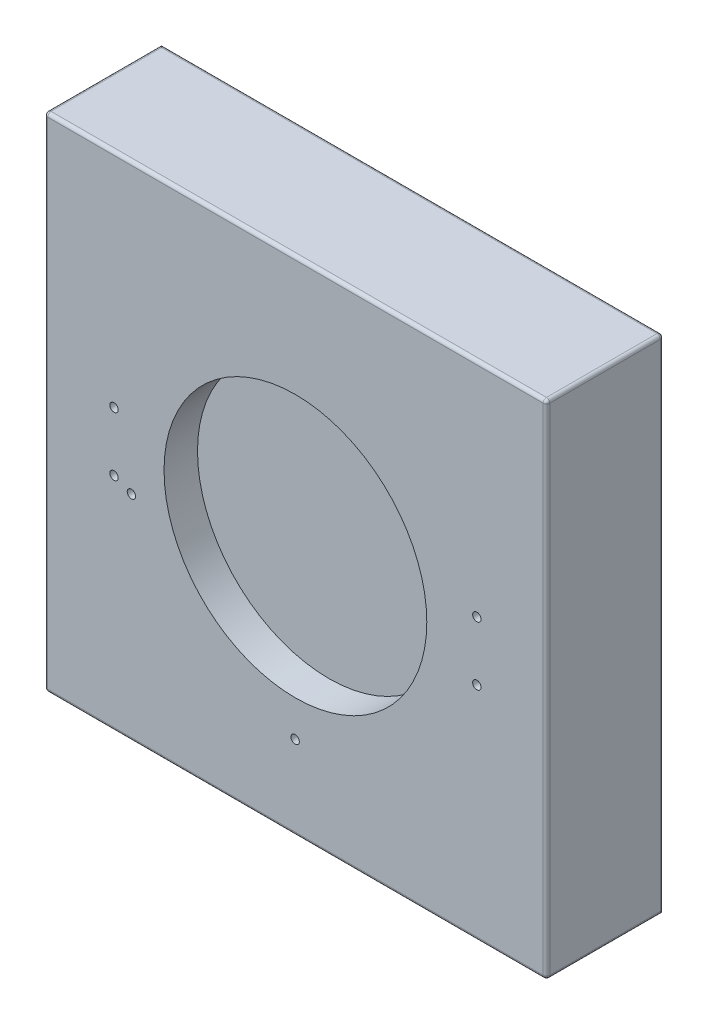
ISO-10303-21;
HEADER;
FILE_DESCRIPTION(('STEP AP214'),'2;1');
FILE_NAME('part.step','',(''),(''),'','','');
FILE_SCHEMA(('AUTOMOTIVE_DESIGN { 1 0 10303 214 1 1 1 1 }'));
ENDSEC;
DATA;
#1=APPLICATION_CONTEXT('core data for automotive mechanical design processes');
#2=APPLICATION_PROTOCOL_DEFINITION('international standard','automotive_design',2000,#1);
#3=PRODUCT_CONTEXT('',#1,'mechanical');
#4=PRODUCT('Part','Part','',(#3));
#5=PRODUCT_RELATED_PRODUCT_CATEGORY('part','',(#4));
#6=PRODUCT_DEFINITION_FORMATION('','',#4);
#7=PRODUCT_DEFINITION_CONTEXT('part definition',#1,'design');
#8=PRODUCT_DEFINITION('design','',#6,#7);
#9=PRODUCT_DEFINITION_SHAPE('','',#8);
#10=(LENGTH_UNIT() NAMED_UNIT(*) SI_UNIT(.MILLI.,.METRE.));
#11=(NAMED_UNIT(*) PLANE_ANGLE_UNIT() SI_UNIT($,.RADIAN.));
#12=(NAMED_UNIT(*) SI_UNIT($,.STERADIAN.) SOLID_ANGLE_UNIT());
#13=UNCERTAINTY_MEASURE_WITH_UNIT(LENGTH_MEASURE(1.E-05),#10,'distance_accuracy_value','');
#14=(GEOMETRIC_REPRESENTATION_CONTEXT(3) GLOBAL_UNCERTAINTY_ASSIGNED_CONTEXT((#13)) GLOBAL_UNIT_ASSIGNED_CONTEXT((#10,
#11,#12)) REPRESENTATION_CONTEXT('',''));
#15=CARTESIAN_POINT('',(0.,0.,0.));
#16=DIRECTION('',(0.,0.,1.));
#17=DIRECTION('',(1.,0.,0.));
#18=AXIS2_PLACEMENT_3D('',#15,#16,#17);
#19=CARTESIAN_POINT('',(-75.,-75.,-35.));
#20=DIRECTION('',(0.,-1.,0.));
#21=DIRECTION('',(0.,0.,-1.));
#22=AXIS2_PLACEMENT_3D('',#19,#20,#21);
#23=PLANE('',#22);
#24=DIRECTION('',(1.,0.,0.));
#25=VECTOR('',#24,1.);
#26=CARTESIAN_POINT('',(-75.,-75.,-35.));
#27=LINE('',#26,#25);
#28=CARTESIAN_POINT('',(-74.,-75.,-35.));
#29=VERTEX_POINT('',#28);
#30=CARTESIAN_POINT('',(74.,-75.,-35.));
#31=VERTEX_POINT('',#30);
#32=EDGE_CURVE('E254',#29,#31,#27,.T.);
#33=ORIENTED_EDGE('',*,*,#32,.T.);
#34=DIRECTION('',(0.,0.,1.));
#35=VECTOR('',#34,1.);
#36=CARTESIAN_POINT('',(74.,-75.,-35.));
#37=LINE('',#36,#35);
#38=CARTESIAN_POINT('',(74.,-75.,-1.));
#39=VERTEX_POINT('',#38);
#40=EDGE_CURVE('E268',#31,#39,#37,.T.);
#41=ORIENTED_EDGE('',*,*,#40,.T.);
#42=DIRECTION('',(1.,0.,0.));
#43=VECTOR('',#42,1.);
#44=CARTESIAN_POINT('',(-75.,-75.,-1.));
#45=LINE('',#44,#43);
#46=CARTESIAN_POINT('',(-74.,-75.,-1.));
#47=VERTEX_POINT('',#46);
#48=EDGE_CURVE('E262',#39,#47,#45,.F.);
#49=ORIENTED_EDGE('',*,*,#48,.T.);
#50=DIRECTION('',(0.,0.,1.));
#51=VECTOR('',#50,1.);
#52=CARTESIAN_POINT('',(-74.,-75.,-35.));
#53=LINE('',#52,#51);
#54=EDGE_CURVE('E265',#47,#29,#53,.F.);
#55=ORIENTED_EDGE('',*,*,#54,.T.);
#56=EDGE_LOOP('',(#33,#41,#49,#55));
#57=FACE_BOUND('',#56,.T.);
#58=ADVANCED_FACE('F41',(#57),#23,.T.);
#59=CARTESIAN_POINT('',(-75.,-75.,-35.));
#60=DIRECTION('',(1.,0.,0.));
#61=DIRECTION('',(0.,0.,-1.));
#62=AXIS2_PLACEMENT_3D('',#59,#60,#61);
#63=PLANE('',#62);
#64=DIRECTION('',(0.,1.,0.));
#65=VECTOR('',#64,1.);
#66=CARTESIAN_POINT('',(-75.,-75.,-35.));
#67=LINE('',#66,#65);
#68=CARTESIAN_POINT('',(-75.,-74.,-35.));
#69=VERTEX_POINT('',#68);
#70=CARTESIAN_POINT('',(-75.,74.,-35.));
#71=VERTEX_POINT('',#70);
#72=EDGE_CURVE('E258',#69,#71,#67,.T.);
#73=ORIENTED_EDGE('',*,*,#72,.F.);
#74=DIRECTION('',(0.,0.,1.));
#75=VECTOR('',#74,1.);
#76=CARTESIAN_POINT('',(-75.,-74.,0.));
#77=LINE('',#76,#75);
#78=CARTESIAN_POINT('',(-75.,-74.,-1.));
#79=VERTEX_POINT('',#78);
#80=EDGE_CURVE('E291',#69,#79,#77,.T.);
#81=ORIENTED_EDGE('',*,*,#80,.T.);
#82=DIRECTION('',(0.,1.,0.));
#83=VECTOR('',#82,1.);
#84=CARTESIAN_POINT('',(-75.,75.,-1.));
#85=LINE('',#84,#83);
#86=CARTESIAN_POINT('',(-75.,74.,-1.));
#87=VERTEX_POINT('',#86);
#88=EDGE_CURVE('E285',#79,#87,#85,.T.);
#89=ORIENTED_EDGE('',*,*,#88,.T.);
#90=DIRECTION('',(0.,0.,1.));
#91=VECTOR('',#90,1.);
#92=CARTESIAN_POINT('',(-75.,74.,-35.));
#93=LINE('',#92,#91);
#94=EDGE_CURVE('E288',#87,#71,#93,.F.);
#95=ORIENTED_EDGE('',*,*,#94,.T.);
#96=EDGE_LOOP('',(#73,#81,#89,#95));
#97=FACE_BOUND('',#96,.T.);
#98=ADVANCED_FACE('F466',(#97),#63,.F.);
#99=CARTESIAN_POINT('',(-75.,75.,-35.));
#100=DIRECTION('',(0.,-1.,0.));
#101=DIRECTION('',(0.,0.,-1.));
#102=AXIS2_PLACEMENT_3D('',#99,#100,#101);
#103=PLANE('',#102);
#104=DIRECTION('',(1.,0.,0.));
#105=VECTOR('',#104,1.);
#106=CARTESIAN_POINT('',(-75.,75.,-34.));
#107=LINE('',#106,#105);
#108=CARTESIAN_POINT('',(74.,75.,-34.));
#109=VERTEX_POINT('',#108);
#110=CARTESIAN_POINT('',(-74.,75.,-34.));
#111=VERTEX_POINT('',#110);
#112=EDGE_CURVE('E309',#109,#111,#107,.F.);
#113=ORIENTED_EDGE('',*,*,#112,.T.);
#114=DIRECTION('',(0.,0.,1.));
#115=VECTOR('',#114,1.);
#116=CARTESIAN_POINT('',(-74.,75.,-35.));
#117=LINE('',#116,#115);
#118=CARTESIAN_POINT('',(-74.,75.,-1.));
#119=VERTEX_POINT('',#118);
#120=EDGE_CURVE('E312',#111,#119,#117,.T.);
#121=ORIENTED_EDGE('',*,*,#120,.T.);
#122=DIRECTION('',(1.,0.,0.));
#123=VECTOR('',#122,1.);
#124=CARTESIAN_POINT('',(75.,75.,-1.));
#125=LINE('',#124,#123);
#126=CARTESIAN_POINT('',(74.,75.,-1.));
#127=VERTEX_POINT('',#126);
#128=EDGE_CURVE('E303',#119,#127,#125,.T.);
#129=ORIENTED_EDGE('',*,*,#128,.T.);
#130=DIRECTION('',(0.,0.,1.));
#131=VECTOR('',#130,1.);
#132=CARTESIAN_POINT('',(74.,75.,-35.));
#133=LINE('',#132,#131);
#134=EDGE_CURVE('E306',#127,#109,#133,.F.);
#135=ORIENTED_EDGE('',*,*,#134,.T.);
#136=EDGE_LOOP('',(#113,#121,#129,#135));
#137=FACE_BOUND('',#136,.T.);
#138=ADVANCED_FACE('F396',(#137),#103,.F.);
#139=CARTESIAN_POINT('',(75.,-75.,-35.));
#140=DIRECTION('',(1.,0.,0.));
#141=DIRECTION('',(0.,0.,-1.));
#142=AXIS2_PLACEMENT_3D('',#139,#140,#141);
#143=PLANE('',#142);
#144=DIRECTION('',(0.,1.,0.));
#145=VECTOR('',#144,1.);
#146=CARTESIAN_POINT('',(75.,-75.,-1.));
#147=LINE('',#146,#145);
#148=CARTESIAN_POINT('',(75.,74.,-1.));
#149=VERTEX_POINT('',#148);
#150=CARTESIAN_POINT('',(75.,-74.,-1.));
#151=VERTEX_POINT('',#150);
#152=EDGE_CURVE('E272',#149,#151,#147,.F.);
#153=ORIENTED_EDGE('',*,*,#152,.T.);
#154=DIRECTION('',(0.,0.,1.));
#155=VECTOR('',#154,1.);
#156=CARTESIAN_POINT('',(75.,-74.,-35.));
#157=LINE('',#156,#155);
#158=CARTESIAN_POINT('',(75.,-74.,-34.));
#159=VERTEX_POINT('',#158);
#160=EDGE_CURVE('E281',#151,#159,#157,.F.);
#161=ORIENTED_EDGE('',*,*,#160,.T.);
#162=DIRECTION('',(0.,1.,0.));
#163=VECTOR('',#162,1.);
#164=CARTESIAN_POINT('',(75.,75.,-34.));
#165=LINE('',#164,#163);
#166=CARTESIAN_POINT('',(75.,74.,-34.));
#167=VERTEX_POINT('',#166);
#168=EDGE_CURVE('E278',#159,#167,#165,.T.);
#169=ORIENTED_EDGE('',*,*,#168,.T.);
#170=DIRECTION('',(0.,0.,1.));
#171=VECTOR('',#170,1.);
#172=CARTESIAN_POINT('',(75.,74.,0.));
#173=LINE('',#172,#171);
#174=EDGE_CURVE('E275',#167,#149,#173,.T.);
#175=ORIENTED_EDGE('',*,*,#174,.T.);
#176=EDGE_LOOP('',(#153,#161,#169,#175));
#177=FACE_BOUND('',#176,.T.);
#178=ADVANCED_FACE('F450',(#177),#143,.T.);
#179=CARTESIAN_POINT('',(0.,0.,-35.));
#180=DIRECTION('',(0.,0.,1.));
#181=DIRECTION('',(1.,0.,0.));
#182=AXIS2_PLACEMENT_3D('',#179,#180,#181);
#183=PLANE('',#182);
#184=DIRECTION('',(1.,0.,0.));
#185=VECTOR('',#184,1.);
#186=CARTESIAN_POINT('',(20.05,25.,-35.));
#187=LINE('',#186,#185);
#188=CARTESIAN_POINT('',(-20.05,25.,-35.));
#189=VERTEX_POINT('',#188);
#190=CARTESIAN_POINT('',(20.05,25.,-35.));
#191=VERTEX_POINT('',#190);
#192=EDGE_CURVE('E183',#189,#191,#187,.T.);
#193=ORIENTED_EDGE('',*,*,#192,.F.);
#194=DIRECTION('',(0.,1.,0.));
#195=VECTOR('',#194,1.);
#196=CARTESIAN_POINT('',(-20.05,-25.,-35.));
#197=LINE('',#196,#195);
#198=CARTESIAN_POINT('',(-20.05,-25.,-35.));
#199=VERTEX_POINT('',#198);
#200=EDGE_CURVE('E59',#199,#189,#197,.T.);
#201=ORIENTED_EDGE('',*,*,#200,.F.);
#202=DIRECTION('',(-1.,0.,0.));
#203=VECTOR('',#202,1.);
#204=CARTESIAN_POINT('',(20.05,-25.,-35.));
#205=LINE('',#204,#203);
#206=CARTESIAN_POINT('',(20.05,-25.,-35.));
#207=VERTEX_POINT('',#206);
#208=EDGE_CURVE('E170',#207,#199,#205,.T.);
#209=ORIENTED_EDGE('',*,*,#208,.F.);
#210=DIRECTION('',(0.,-1.,0.));
#211=VECTOR('',#210,1.);
#212=CARTESIAN_POINT('',(20.05,-25.,-35.));
#213=LINE('',#212,#211);
#214=EDGE_CURVE('E174',#191,#207,#213,.T.);
#215=ORIENTED_EDGE('',*,*,#214,.F.);
#216=EDGE_LOOP('',(#193,#201,#209,#215));
#217=FACE_BOUND('',#216,.T.);
#218=CARTESIAN_POINT('',(-0.0838926930277757,-49.9999774777312,-35.));
#219=DIRECTION('',(0.,0.,1.));
#220=DIRECTION('',(1.,0.,0.));
#221=AXIS2_PLACEMENT_3D('',#218,#219,#220);
#222=CIRCLE('',#221,1.24999999999999);
#223=CARTESIAN_POINT('',(1.16610730697222,-49.9999774777312,-35.));
#224=VERTEX_POINT('',#223);
#225=EDGE_CURVE('E201',#224,#224,#222,.T.);
#226=ORIENTED_EDGE('',*,*,#225,.T.);
#227=EDGE_LOOP('',(#226));
#228=FACE_BOUND('',#227,.T.);
#229=CARTESIAN_POINT('',(-49.,-11.,-35.));
#230=DIRECTION('',(0.,0.,1.));
#231=DIRECTION('',(1.,0.,0.));
#232=AXIS2_PLACEMENT_3D('',#229,#230,#231);
#233=CIRCLE('',#232,1.24999999999999);
#234=CARTESIAN_POINT('',(-47.75,-11.,-35.));
#235=VERTEX_POINT('',#234);
#236=EDGE_CURVE('E209',#235,#235,#233,.T.);
#237=ORIENTED_EDGE('',*,*,#236,.T.);
#238=EDGE_LOOP('',(#237));
#239=FACE_BOUND('',#238,.T.);
#240=CARTESIAN_POINT('',(-54.190883487963,-8.80000000000003,-35.));
#241=DIRECTION('',(0.,0.,1.));
#242=DIRECTION('',(1.,0.,0.));
#243=AXIS2_PLACEMENT_3D('',#240,#241,#242);
#244=CIRCLE('',#243,1.24999999999999);
#245=CARTESIAN_POINT('',(-52.940883487963,-8.80000000000003,-35.));
#246=VERTEX_POINT('',#245);
#247=EDGE_CURVE('E217',#246,#246,#244,.T.);
#248=ORIENTED_EDGE('',*,*,#247,.T.);
#249=EDGE_LOOP('',(#248));
#250=FACE_BOUND('',#249,.T.);
#251=CARTESIAN_POINT('',(-54.190883487963,8.79999999999997,-35.));
#252=DIRECTION('',(0.,0.,1.));
#253=DIRECTION('',(1.,0.,0.));
#254=AXIS2_PLACEMENT_3D('',#251,#252,#253);
#255=CIRCLE('',#254,1.24999999999999);
#256=CARTESIAN_POINT('',(-52.940883487963,8.79999999999997,-35.));
#257=VERTEX_POINT('',#256);
#258=EDGE_CURVE('E225',#257,#257,#255,.T.);
#259=ORIENTED_EDGE('',*,*,#258,.T.);
#260=EDGE_LOOP('',(#259));
#261=FACE_BOUND('',#260,.T.);
#262=CARTESIAN_POINT('',(54.1908834879629,-8.80000000000003,-35.));
#263=DIRECTION('',(0.,0.,1.));
#264=DIRECTION('',(1.,0.,0.));
#265=AXIS2_PLACEMENT_3D('',#262,#263,#264);
#266=CIRCLE('',#265,1.24999999999999);
#267=CARTESIAN_POINT('',(55.4408834879629,-8.80000000000003,-35.));
#268=VERTEX_POINT('',#267);
#269=EDGE_CURVE('E233',#268,#268,#266,.T.);
#270=ORIENTED_EDGE('',*,*,#269,.T.);
#271=EDGE_LOOP('',(#270));
#272=FACE_BOUND('',#271,.T.);
#273=CARTESIAN_POINT('',(54.1908834879629,8.79999999999998,-35.));
#274=DIRECTION('',(0.,0.,1.));
#275=DIRECTION('',(1.,0.,0.));
#276=AXIS2_PLACEMENT_3D('',#273,#274,#275);
#277=CIRCLE('',#276,1.24999999999999);
#278=CARTESIAN_POINT('',(55.4408834879629,8.79999999999998,-35.));
#279=VERTEX_POINT('',#278);
#280=EDGE_CURVE('E241',#279,#279,#277,.T.);
#281=ORIENTED_EDGE('',*,*,#280,.T.);
#282=EDGE_LOOP('',(#281));
#283=FACE_BOUND('',#282,.T.);
#284=ORIENTED_EDGE('',*,*,#32,.F.);
#285=CARTESIAN_POINT('',(-74.,-74.,-35.));
#286=DIRECTION('',(0.,0.,1.));
#287=DIRECTION('',(1.,0.,0.));
#288=AXIS2_PLACEMENT_3D('',#285,#286,#287);
#289=CIRCLE('',#288,1.);
#290=EDGE_CURVE('E300',#29,#69,#289,.F.);
#291=ORIENTED_EDGE('',*,*,#290,.T.);
#292=ORIENTED_EDGE('',*,*,#72,.T.);
#293=DIRECTION('',(1.,0.,0.));
#294=VECTOR('',#293,1.);
#295=CARTESIAN_POINT('',(0.,74.,-35.));
#296=LINE('',#295,#294);
#297=CARTESIAN_POINT('',(74.,74.,-35.));
#298=VERTEX_POINT('',#297);
#299=EDGE_CURVE('E294',#71,#298,#296,.T.);
#300=ORIENTED_EDGE('',*,*,#299,.T.);
#301=DIRECTION('',(0.,1.,0.));
#302=VECTOR('',#301,1.);
#303=CARTESIAN_POINT('',(74.,-75.,-35.));
#304=LINE('',#303,#302);
#305=EDGE_CURVE('E297',#298,#31,#304,.F.);
#306=ORIENTED_EDGE('',*,*,#305,.T.);
#307=EDGE_LOOP('',(#284,#291,#292,#300,#306));
#308=FACE_BOUND('',#307,.T.);
#309=ADVANCED_FACE('F420',(#217,#228,#239,#250,#261,#272,#283,#308),#183,.F.);
#310=CARTESIAN_POINT('',(0.,0.,0.));
#311=DIRECTION('',(0.,0.,1.));
#312=DIRECTION('',(1.,0.,0.));
#313=AXIS2_PLACEMENT_3D('',#310,#311,#312);
#314=PLANE('',#313);
#315=CARTESIAN_POINT('',(-0.0838926930277757,-49.9999774777312,0.));
#316=DIRECTION('',(0.,0.,1.));
#317=DIRECTION('',(1.,0.,0.));
#318=AXIS2_PLACEMENT_3D('',#315,#316,#317);
#319=CIRCLE('',#318,1.25);
#320=CARTESIAN_POINT('',(1.16610730697222,-49.9999774777312,0.));
#321=VERTEX_POINT('',#320);
#322=EDGE_CURVE('E192',#321,#321,#319,.T.);
#323=ORIENTED_EDGE('',*,*,#322,.F.);
#324=EDGE_LOOP('',(#323));
#325=FACE_BOUND('',#324,.T.);
#326=CARTESIAN_POINT('',(-49.,-11.,0.));
#327=DIRECTION('',(0.,0.,1.));
#328=DIRECTION('',(1.,0.,0.));
#329=AXIS2_PLACEMENT_3D('',#326,#327,#328);
#330=CIRCLE('',#329,1.24999999999999);
#331=CARTESIAN_POINT('',(-47.75,-11.,0.));
#332=VERTEX_POINT('',#331);
#333=EDGE_CURVE('E205',#332,#332,#330,.T.);
#334=ORIENTED_EDGE('',*,*,#333,.F.);
#335=EDGE_LOOP('',(#334));
#336=FACE_BOUND('',#335,.T.);
#337=CARTESIAN_POINT('',(-54.190883487963,-8.80000000000003,0.));
#338=DIRECTION('',(0.,0.,1.));
#339=DIRECTION('',(1.,0.,0.));
#340=AXIS2_PLACEMENT_3D('',#337,#338,#339);
#341=CIRCLE('',#340,1.24999999999999);
#342=CARTESIAN_POINT('',(-52.940883487963,-8.80000000000003,0.));
#343=VERTEX_POINT('',#342);
#344=EDGE_CURVE('E213',#343,#343,#341,.T.);
#345=ORIENTED_EDGE('',*,*,#344,.F.);
#346=EDGE_LOOP('',(#345));
#347=FACE_BOUND('',#346,.T.);
#348=CARTESIAN_POINT('',(-54.190883487963,8.79999999999997,0.));
#349=DIRECTION('',(0.,0.,1.));
#350=DIRECTION('',(1.,0.,0.));
#351=AXIS2_PLACEMENT_3D('',#348,#349,#350);
#352=CIRCLE('',#351,1.24999999999999);
#353=CARTESIAN_POINT('',(-52.940883487963,8.79999999999997,0.));
#354=VERTEX_POINT('',#353);
#355=EDGE_CURVE('E221',#354,#354,#352,.T.);
#356=ORIENTED_EDGE('',*,*,#355,.F.);
#357=EDGE_LOOP('',(#356));
#358=FACE_BOUND('',#357,.T.);
#359=CARTESIAN_POINT('',(54.1908834879629,-8.80000000000003,0.));
#360=DIRECTION('',(0.,0.,1.));
#361=DIRECTION('',(1.,0.,0.));
#362=AXIS2_PLACEMENT_3D('',#359,#360,#361);
#363=CIRCLE('',#362,1.24999999999999);
#364=CARTESIAN_POINT('',(55.4408834879629,-8.80000000000003,0.));
#365=VERTEX_POINT('',#364);
#366=EDGE_CURVE('E229',#365,#365,#363,.T.);
#367=ORIENTED_EDGE('',*,*,#366,.F.);
#368=EDGE_LOOP('',(#367));
#369=FACE_BOUND('',#368,.T.);
#370=CARTESIAN_POINT('',(54.1908834879629,8.79999999999998,0.));
#371=DIRECTION('',(0.,0.,1.));
#372=DIRECTION('',(1.,0.,0.));
#373=AXIS2_PLACEMENT_3D('',#370,#371,#372);
#374=CIRCLE('',#373,1.24999999999999);
#375=CARTESIAN_POINT('',(55.4408834879629,8.79999999999998,0.));
#376=VERTEX_POINT('',#375);
#377=EDGE_CURVE('E237',#376,#376,#374,.T.);
#378=ORIENTED_EDGE('',*,*,#377,.F.);
#379=EDGE_LOOP('',(#378));
#380=FACE_BOUND('',#379,.T.);
#381=CARTESIAN_POINT('',(0.,0.,0.));
#382=DIRECTION('',(0.,0.,1.));
#383=DIRECTION('',(1.,0.,0.));
#384=AXIS2_PLACEMENT_3D('',#381,#382,#383);
#385=CIRCLE('',#384,39.25);
#386=CARTESIAN_POINT('',(39.25,0.,0.));
#387=VERTEX_POINT('',#386);
#388=EDGE_CURVE('E245',#387,#387,#385,.T.);
#389=ORIENTED_EDGE('',*,*,#388,.F.);
#390=EDGE_LOOP('',(#389));
#391=FACE_BOUND('',#390,.T.);
#392=DIRECTION('',(0.,1.,0.));
#393=VECTOR('',#392,1.);
#394=CARTESIAN_POINT('',(-74.,-75.,0.));
#395=LINE('',#394,#393);
#396=CARTESIAN_POINT('',(-74.,74.,0.));
#397=VERTEX_POINT('',#396);
#398=CARTESIAN_POINT('',(-74.,-74.,0.));
#399=VERTEX_POINT('',#398);
#400=EDGE_CURVE('E51',#397,#399,#395,.F.);
#401=ORIENTED_EDGE('',*,*,#400,.T.);
#402=DIRECTION('',(1.,0.,0.));
#403=VECTOR('',#402,1.);
#404=CARTESIAN_POINT('',(0.,-74.,0.));
#405=LINE('',#404,#403);
#406=CARTESIAN_POINT('',(74.,-74.,0.));
#407=VERTEX_POINT('',#406);
#408=EDGE_CURVE('E11',#399,#407,#405,.T.);
#409=ORIENTED_EDGE('',*,*,#408,.T.);
#410=DIRECTION('',(0.,1.,0.));
#411=VECTOR('',#410,1.);
#412=CARTESIAN_POINT('',(74.,0.,0.));
#413=LINE('',#412,#411);
#414=CARTESIAN_POINT('',(74.,74.,0.));
#415=VERTEX_POINT('',#414);
#416=EDGE_CURVE('E319',#407,#415,#413,.T.);
#417=ORIENTED_EDGE('',*,*,#416,.T.);
#418=DIRECTION('',(1.,0.,0.));
#419=VECTOR('',#418,1.);
#420=CARTESIAN_POINT('',(-75.,74.,0.));
#421=LINE('',#420,#419);
#422=EDGE_CURVE('E316',#415,#397,#421,.F.);
#423=ORIENTED_EDGE('',*,*,#422,.T.);
#424=EDGE_LOOP('',(#401,#409,#417,#423));
#425=FACE_BOUND('',#424,.T.);
#426=ADVANCED_FACE('F437',(#325,#336,#347,#358,#369,#380,#391,#425),#314,.T.);
#427=CARTESIAN_POINT('',(-74.,74.,-1.));
#428=DIRECTION('',(-1.,0.,0.));
#429=DIRECTION('',(0.,0.,1.));
#430=AXIS2_PLACEMENT_3D('',#427,#428,#429);
#431=SPHERICAL_SURFACE('',#430,1.);
#432=CARTESIAN_POINT('',(-74.,74.,-1.));
#433=DIRECTION('',(-1.,0.,0.));
#434=DIRECTION('',(0.,0.,1.));
#435=AXIS2_PLACEMENT_3D('',#432,#433,#434);
#436=CIRCLE('',#435,1.);
#437=EDGE_CURVE('E376',#119,#397,#436,.F.);
#438=ORIENTED_EDGE('',*,*,#437,.F.);
#439=CARTESIAN_POINT('',(-74.,74.,-1.));
#440=DIRECTION('',(0.,0.,1.));
#441=DIRECTION('',(1.,0.,0.));
#442=AXIS2_PLACEMENT_3D('',#439,#440,#441);
#443=CIRCLE('',#442,1.);
#444=EDGE_CURVE('E45',#87,#119,#443,.F.);
#445=ORIENTED_EDGE('',*,*,#444,.F.);
#446=CARTESIAN_POINT('',(-74.,74.,-1.));
#447=DIRECTION('',(0.,1.,0.));
#448=DIRECTION('',(0.,0.,1.));
#449=AXIS2_PLACEMENT_3D('',#446,#447,#448);
#450=CIRCLE('',#449,1.);
#451=EDGE_CURVE('E379',#397,#87,#450,.F.);
#452=ORIENTED_EDGE('',*,*,#451,.F.);
#453=EDGE_LOOP('',(#438,#445,#452));
#454=FACE_BOUND('',#453,.T.);
#455=ADVANCED_FACE('F43',(#454),#431,.T.);
#456=CARTESIAN_POINT('',(-74.,74.,-35.));
#457=DIRECTION('',(0.,0.,1.));
#458=DIRECTION('',(1.,0.,0.));
#459=AXIS2_PLACEMENT_3D('',#456,#457,#458);
#460=CYLINDRICAL_SURFACE('',#459,1.);
#461=ORIENTED_EDGE('',*,*,#444,.T.);
#462=ORIENTED_EDGE('',*,*,#120,.F.);
#463=CARTESIAN_POINT('',(-74.,74.,-34.));
#464=DIRECTION('',(0.707106781186547,0.,-0.707106781186547));
#465=DIRECTION('',(0.707106781186547,0.,0.707106781186547));
#466=AXIS2_PLACEMENT_3D('',#463,#464,#465);
#467=ELLIPSE('',#466,1.41421356237309,1.);
#468=EDGE_CURVE('E372',#71,#111,#467,.T.);
#469=ORIENTED_EDGE('',*,*,#468,.F.);
#470=ORIENTED_EDGE('',*,*,#94,.F.);
#471=EDGE_LOOP('',(#461,#462,#469,#470));
#472=FACE_BOUND('',#471,.T.);
#473=ADVANCED_FACE('F391',(#472),#460,.T.);
#474=CARTESIAN_POINT('',(-74.,-74.,-35.));
#475=DIRECTION('',(0.,0.,-1.));
#476=DIRECTION('',(-1.,0.,0.));
#477=AXIS2_PLACEMENT_3D('',#474,#475,#476);
#478=CYLINDRICAL_SURFACE('',#477,1.);
#479=ORIENTED_EDGE('',*,*,#290,.F.);
#480=ORIENTED_EDGE('',*,*,#54,.F.);
#481=CARTESIAN_POINT('',(-74.,-74.,-1.));
#482=DIRECTION('',(0.,0.,1.));
#483=DIRECTION('',(0.,-1.,0.));
#484=AXIS2_PLACEMENT_3D('',#481,#482,#483);
#485=CIRCLE('',#484,1.);
#486=EDGE_CURVE('E368',#79,#47,#485,.T.);
#487=ORIENTED_EDGE('',*,*,#486,.F.);
#488=ORIENTED_EDGE('',*,*,#80,.F.);
#489=EDGE_LOOP('',(#479,#480,#487,#488));
#490=FACE_BOUND('',#489,.T.);
#491=ADVANCED_FACE('F427',(#490),#478,.T.);
#492=CARTESIAN_POINT('',(-74.,-75.,-1.));
#493=DIRECTION('',(0.,-1.,0.));
#494=DIRECTION('',(0.,0.,-1.));
#495=AXIS2_PLACEMENT_3D('',#492,#493,#494);
#496=CYLINDRICAL_SURFACE('',#495,1.);
#497=ORIENTED_EDGE('',*,*,#451,.T.);
#498=ORIENTED_EDGE('',*,*,#88,.F.);
#499=CARTESIAN_POINT('',(-74.,-74.,-1.));
#500=DIRECTION('',(0.,-1.,0.));
#501=DIRECTION('',(0.,0.,-1.));
#502=AXIS2_PLACEMENT_3D('',#499,#500,#501);
#503=CIRCLE('',#502,1.);
#504=EDGE_CURVE('E364',#399,#79,#503,.T.);
#505=ORIENTED_EDGE('',*,*,#504,.F.);
#506=ORIENTED_EDGE('',*,*,#400,.F.);
#507=EDGE_LOOP('',(#497,#498,#505,#506));
#508=FACE_BOUND('',#507,.T.);
#509=ADVANCED_FACE('F659',(#508),#496,.T.);
#510=CARTESIAN_POINT('',(-75.,74.,-1.));
#511=DIRECTION('',(-1.,0.,0.));
#512=DIRECTION('',(0.,0.,1.));
#513=AXIS2_PLACEMENT_3D('',#510,#511,#512);
#514=CYLINDRICAL_SURFACE('',#513,1.);
#515=ORIENTED_EDGE('',*,*,#437,.T.);
#516=ORIENTED_EDGE('',*,*,#422,.F.);
#517=CARTESIAN_POINT('',(74.,74.,-1.));
#518=DIRECTION('',(1.,0.,0.));
#519=DIRECTION('',(0.,0.,-1.));
#520=AXIS2_PLACEMENT_3D('',#517,#518,#519);
#521=CIRCLE('',#520,1.);
#522=EDGE_CURVE('E360',#127,#415,#521,.T.);
#523=ORIENTED_EDGE('',*,*,#522,.F.);
#524=ORIENTED_EDGE('',*,*,#128,.F.);
#525=EDGE_LOOP('',(#515,#516,#523,#524));
#526=FACE_BOUND('',#525,.T.);
#527=ADVANCED_FACE('F442',(#526),#514,.T.);
#528=CARTESIAN_POINT('',(74.,74.,-35.));
#529=DIRECTION('',(0.,0.,-1.));
#530=DIRECTION('',(-1.,0.,0.));
#531=AXIS2_PLACEMENT_3D('',#528,#529,#530);
#532=CYLINDRICAL_SURFACE('',#531,1.);
#533=CARTESIAN_POINT('',(74.,74.,-34.));
#534=DIRECTION('',(0.,0.,-1.));
#535=DIRECTION('',(-1.,0.,0.));
#536=AXIS2_PLACEMENT_3D('',#533,#534,#535);
#537=CIRCLE('',#536,1.);
#538=EDGE_CURVE('E352',#109,#167,#537,.T.);
#539=ORIENTED_EDGE('',*,*,#538,.F.);
#540=ORIENTED_EDGE('',*,*,#134,.F.);
#541=CARTESIAN_POINT('',(74.,74.,-1.));
#542=DIRECTION('',(0.,0.,1.));
#543=DIRECTION('',(0.,-1.,0.));
#544=AXIS2_PLACEMENT_3D('',#541,#542,#543);
#545=CIRCLE('',#544,1.);
#546=EDGE_CURVE('E356',#149,#127,#545,.T.);
#547=ORIENTED_EDGE('',*,*,#546,.F.);
#548=ORIENTED_EDGE('',*,*,#174,.F.);
#549=EDGE_LOOP('',(#539,#540,#547,#548));
#550=FACE_BOUND('',#549,.T.);
#551=ADVANCED_FACE('F407',(#550),#532,.T.);
#552=CARTESIAN_POINT('',(0.,74.,-34.));
#553=DIRECTION('',(1.,0.,0.));
#554=DIRECTION('',(0.,0.,-1.));
#555=AXIS2_PLACEMENT_3D('',#552,#553,#554);
#556=CYLINDRICAL_SURFACE('',#555,1.);
#557=ORIENTED_EDGE('',*,*,#468,.T.);
#558=ORIENTED_EDGE('',*,*,#112,.F.);
#559=CARTESIAN_POINT('',(74.,74.,-34.));
#560=DIRECTION('',(1.,0.,0.));
#561=DIRECTION('',(0.,0.,-1.));
#562=AXIS2_PLACEMENT_3D('',#559,#560,#561);
#563=CIRCLE('',#562,1.);
#564=EDGE_CURVE('E348',#298,#109,#563,.T.);
#565=ORIENTED_EDGE('',*,*,#564,.F.);
#566=ORIENTED_EDGE('',*,*,#299,.F.);
#567=EDGE_LOOP('',(#557,#558,#565,#566));
#568=FACE_BOUND('',#567,.T.);
#569=ADVANCED_FACE('F402',(#568),#556,.T.);
#570=CARTESIAN_POINT('',(-74.,-74.,-1.));
#571=DIRECTION('',(-1.,0.,0.));
#572=DIRECTION('',(0.,0.,1.));
#573=AXIS2_PLACEMENT_3D('',#570,#571,#572);
#574=SPHERICAL_SURFACE('',#573,1.);
#575=ORIENTED_EDGE('',*,*,#504,.T.);
#576=ORIENTED_EDGE('',*,*,#486,.T.);
#577=CARTESIAN_POINT('',(-74.,-74.,-1.));
#578=DIRECTION('',(-1.,0.,0.));
#579=DIRECTION('',(0.,0.,1.));
#580=AXIS2_PLACEMENT_3D('',#577,#578,#579);
#581=CIRCLE('',#580,1.);
#582=EDGE_CURVE('E344',#399,#47,#581,.F.);
#583=ORIENTED_EDGE('',*,*,#582,.F.);
#584=EDGE_LOOP('',(#575,#576,#583));
#585=FACE_BOUND('',#584,.T.);
#586=ADVANCED_FACE('F431',(#585),#574,.T.);
#587=CARTESIAN_POINT('',(74.,74.,-1.));
#588=DIRECTION('',(0.,1.,0.));
#589=DIRECTION('',(0.,0.,1.));
#590=AXIS2_PLACEMENT_3D('',#587,#588,#589);
#591=SPHERICAL_SURFACE('',#590,1.);
#592=ORIENTED_EDGE('',*,*,#546,.T.);
#593=ORIENTED_EDGE('',*,*,#522,.T.);
#594=CARTESIAN_POINT('',(74.,74.,-1.));
#595=DIRECTION('',(0.,1.,0.));
#596=DIRECTION('',(0.,0.,1.));
#597=AXIS2_PLACEMENT_3D('',#594,#595,#596);
#598=CIRCLE('',#597,1.);
#599=EDGE_CURVE('E340',#149,#415,#598,.F.);
#600=ORIENTED_EDGE('',*,*,#599,.F.);
#601=EDGE_LOOP('',(#592,#593,#600));
#602=FACE_BOUND('',#601,.T.);
#603=ADVANCED_FACE('F445',(#602),#591,.T.);
#604=CARTESIAN_POINT('',(74.,74.,-34.));
#605=DIRECTION('',(0.,1.,0.));
#606=DIRECTION('',(0.,0.,1.));
#607=AXIS2_PLACEMENT_3D('',#604,#605,#606);
#608=SPHERICAL_SURFACE('',#607,1.);
#609=ORIENTED_EDGE('',*,*,#564,.T.);
#610=ORIENTED_EDGE('',*,*,#538,.T.);
#611=CARTESIAN_POINT('',(74.,74.,-34.));
#612=DIRECTION('',(0.,1.,0.));
#613=DIRECTION('',(0.,0.,1.));
#614=AXIS2_PLACEMENT_3D('',#611,#612,#613);
#615=CIRCLE('',#614,1.);
#616=EDGE_CURVE('E336',#298,#167,#615,.F.);
#617=ORIENTED_EDGE('',*,*,#616,.F.);
#618=EDGE_LOOP('',(#609,#610,#617));
#619=FACE_BOUND('',#618,.T.);
#620=ADVANCED_FACE('F411',(#619),#608,.T.);
#621=CARTESIAN_POINT('',(0.,-74.,-1.));
#622=DIRECTION('',(1.,0.,0.));
#623=DIRECTION('',(0.,0.,-1.));
#624=AXIS2_PLACEMENT_3D('',#621,#622,#623);
#625=CYLINDRICAL_SURFACE('',#624,1.);
#626=ORIENTED_EDGE('',*,*,#582,.T.);
#627=ORIENTED_EDGE('',*,*,#48,.F.);
#628=CARTESIAN_POINT('',(74.,-74.,-1.));
#629=DIRECTION('',(1.,0.,0.));
#630=DIRECTION('',(0.,0.,-1.));
#631=AXIS2_PLACEMENT_3D('',#628,#629,#630);
#632=CIRCLE('',#631,1.);
#633=EDGE_CURVE('E332',#407,#39,#632,.T.);
#634=ORIENTED_EDGE('',*,*,#633,.F.);
#635=ORIENTED_EDGE('',*,*,#408,.F.);
#636=EDGE_LOOP('',(#626,#627,#634,#635));
#637=FACE_BOUND('',#636,.T.);
#638=ADVANCED_FACE('F434',(#637),#625,.T.);
#639=CARTESIAN_POINT('',(74.,0.,-1.));
#640=DIRECTION('',(0.,1.,0.));
#641=DIRECTION('',(0.,0.,1.));
#642=AXIS2_PLACEMENT_3D('',#639,#640,#641);
#643=CYLINDRICAL_SURFACE('',#642,1.);
#644=ORIENTED_EDGE('',*,*,#599,.T.);
#645=ORIENTED_EDGE('',*,*,#416,.F.);
#646=CARTESIAN_POINT('',(74.,-74.,-1.));
#647=DIRECTION('',(0.,-1.,0.));
#648=DIRECTION('',(0.,0.,-1.));
#649=AXIS2_PLACEMENT_3D('',#646,#647,#648);
#650=CIRCLE('',#649,1.);
#651=EDGE_CURVE('E329',#151,#407,#650,.T.);
#652=ORIENTED_EDGE('',*,*,#651,.F.);
#653=ORIENTED_EDGE('',*,*,#152,.F.);
#654=EDGE_LOOP('',(#644,#645,#652,#653));
#655=FACE_BOUND('',#654,.T.);
#656=ADVANCED_FACE('F447',(#655),#643,.T.);
#657=CARTESIAN_POINT('',(74.,-75.,-34.));
#658=DIRECTION('',(0.,-1.,0.));
#659=DIRECTION('',(0.,0.,-1.));
#660=AXIS2_PLACEMENT_3D('',#657,#658,#659);
#661=CYLINDRICAL_SURFACE('',#660,1.);
#662=ORIENTED_EDGE('',*,*,#616,.T.);
#663=ORIENTED_EDGE('',*,*,#168,.F.);
#664=CARTESIAN_POINT('',(74.,-74.,-34.));
#665=DIRECTION('',(0.,-0.707106781186547,0.707106781186547));
#666=DIRECTION('',(0.,-0.707106781186547,-0.707106781186547));
#667=AXIS2_PLACEMENT_3D('',#664,#665,#666);
#668=ELLIPSE('',#667,1.41421356237309,1.);
#669=EDGE_CURVE('E326',#31,#159,#668,.T.);
#670=ORIENTED_EDGE('',*,*,#669,.F.);
#671=ORIENTED_EDGE('',*,*,#305,.F.);
#672=EDGE_LOOP('',(#662,#663,#670,#671));
#673=FACE_BOUND('',#672,.T.);
#674=ADVANCED_FACE('F416',(#673),#661,.T.);
#675=CARTESIAN_POINT('',(74.,-74.,-1.));
#676=DIRECTION('',(0.,0.,1.));
#677=DIRECTION('',(1.,0.,0.));
#678=AXIS2_PLACEMENT_3D('',#675,#676,#677);
#679=SPHERICAL_SURFACE('',#678,1.);
#680=ORIENTED_EDGE('',*,*,#651,.T.);
#681=ORIENTED_EDGE('',*,*,#633,.T.);
#682=CARTESIAN_POINT('',(74.,-74.,-1.));
#683=DIRECTION('',(0.,0.,1.));
#684=DIRECTION('',(1.,0.,0.));
#685=AXIS2_PLACEMENT_3D('',#682,#683,#684);
#686=CIRCLE('',#685,1.);
#687=EDGE_CURVE('E250',#151,#39,#686,.F.);
#688=ORIENTED_EDGE('',*,*,#687,.F.);
#689=EDGE_LOOP('',(#680,#681,#688));
#690=FACE_BOUND('',#689,.T.);
#691=ADVANCED_FACE('F455',(#690),#679,.T.);
#692=CARTESIAN_POINT('',(74.,-74.,-35.));
#693=DIRECTION('',(0.,0.,1.));
#694=DIRECTION('',(1.,0.,0.));
#695=AXIS2_PLACEMENT_3D('',#692,#693,#694);
#696=CYLINDRICAL_SURFACE('',#695,1.);
#697=ORIENTED_EDGE('',*,*,#669,.T.);
#698=ORIENTED_EDGE('',*,*,#160,.F.);
#699=ORIENTED_EDGE('',*,*,#687,.T.);
#700=ORIENTED_EDGE('',*,*,#40,.F.);
#701=EDGE_LOOP('',(#697,#698,#699,#700));
#702=FACE_BOUND('',#701,.T.);
#703=ADVANCED_FACE('F453',(#702),#696,.T.);
#704=CARTESIAN_POINT('',(0.,0.,-10.));
#705=DIRECTION('',(0.,0.,1.));
#706=DIRECTION('',(1.,0.,0.));
#707=AXIS2_PLACEMENT_3D('',#704,#705,#706);
#708=CYLINDRICAL_SURFACE('',#707,39.25);
#709=CARTESIAN_POINT('',(0.,0.,-10.));
#710=DIRECTION('',(0.,0.,1.));
#711=DIRECTION('',(1.,0.,0.));
#712=AXIS2_PLACEMENT_3D('',#709,#710,#711);
#713=CIRCLE('',#712,39.25);
#714=CARTESIAN_POINT('',(39.25,0.,-10.));
#715=VERTEX_POINT('',#714);
#716=EDGE_CURVE('E246',#715,#715,#713,.T.);
#717=ORIENTED_EDGE('',*,*,#716,.F.);
#718=EDGE_LOOP('',(#717));
#719=FACE_BOUND('',#718,.T.);
#720=ORIENTED_EDGE('',*,*,#388,.T.);
#721=EDGE_LOOP('',(#720));
#722=FACE_BOUND('',#721,.T.);
#723=ADVANCED_FACE('F462',(#719,#722),#708,.F.);
#724=CARTESIAN_POINT('',(0.,0.,-10.));
#725=DIRECTION('',(0.,0.,1.));
#726=DIRECTION('',(1.,0.,0.));
#727=AXIS2_PLACEMENT_3D('',#724,#725,#726);
#728=PLANE('',#727);
#729=ORIENTED_EDGE('',*,*,#716,.T.);
#730=EDGE_LOOP('',(#729));
#731=FACE_BOUND('',#730,.T.);
#732=ADVANCED_FACE('F486',(#731),#728,.T.);
#733=CARTESIAN_POINT('',(54.1908834879629,8.79999999999998,0.));
#734=DIRECTION('',(0.,0.,1.));
#735=DIRECTION('',(1.,0.,0.));
#736=AXIS2_PLACEMENT_3D('',#733,#734,#735);
#737=CYLINDRICAL_SURFACE('',#736,1.24999999999999);
#738=ORIENTED_EDGE('',*,*,#280,.F.);
#739=EDGE_LOOP('',(#738));
#740=FACE_BOUND('',#739,.T.);
#741=ORIENTED_EDGE('',*,*,#377,.T.);
#742=EDGE_LOOP('',(#741));
#743=FACE_BOUND('',#742,.T.);
#744=ADVANCED_FACE('F490',(#740,#743),#737,.F.);
#745=CARTESIAN_POINT('',(54.1908834879629,-8.80000000000003,0.));
#746=DIRECTION('',(0.,0.,1.));
#747=DIRECTION('',(1.,0.,0.));
#748=AXIS2_PLACEMENT_3D('',#745,#746,#747);
#749=CYLINDRICAL_SURFACE('',#748,1.24999999999999);
#750=ORIENTED_EDGE('',*,*,#269,.F.);
#751=EDGE_LOOP('',(#750));
#752=FACE_BOUND('',#751,.T.);
#753=ORIENTED_EDGE('',*,*,#366,.T.);
#754=EDGE_LOOP('',(#753));
#755=FACE_BOUND('',#754,.T.);
#756=ADVANCED_FACE('F494',(#752,#755),#749,.F.);
#757=CARTESIAN_POINT('',(-54.190883487963,8.79999999999997,0.));
#758=DIRECTION('',(0.,0.,1.));
#759=DIRECTION('',(1.,0.,0.));
#760=AXIS2_PLACEMENT_3D('',#757,#758,#759);
#761=CYLINDRICAL_SURFACE('',#760,1.24999999999999);
#762=ORIENTED_EDGE('',*,*,#258,.F.);
#763=EDGE_LOOP('',(#762));
#764=FACE_BOUND('',#763,.T.);
#765=ORIENTED_EDGE('',*,*,#355,.T.);
#766=EDGE_LOOP('',(#765));
#767=FACE_BOUND('',#766,.T.);
#768=ADVANCED_FACE('F498',(#764,#767),#761,.F.);
#769=CARTESIAN_POINT('',(-54.190883487963,-8.80000000000003,0.));
#770=DIRECTION('',(0.,0.,1.));
#771=DIRECTION('',(1.,0.,0.));
#772=AXIS2_PLACEMENT_3D('',#769,#770,#771);
#773=CYLINDRICAL_SURFACE('',#772,1.24999999999999);
#774=ORIENTED_EDGE('',*,*,#247,.F.);
#775=EDGE_LOOP('',(#774));
#776=FACE_BOUND('',#775,.T.);
#777=ORIENTED_EDGE('',*,*,#344,.T.);
#778=EDGE_LOOP('',(#777));
#779=FACE_BOUND('',#778,.T.);
#780=ADVANCED_FACE('F502',(#776,#779),#773,.F.);
#781=CARTESIAN_POINT('',(-49.,-11.,0.));
#782=DIRECTION('',(0.,0.,1.));
#783=DIRECTION('',(1.,0.,0.));
#784=AXIS2_PLACEMENT_3D('',#781,#782,#783);
#785=CYLINDRICAL_SURFACE('',#784,1.24999999999999);
#786=ORIENTED_EDGE('',*,*,#236,.F.);
#787=EDGE_LOOP('',(#786));
#788=FACE_BOUND('',#787,.T.);
#789=ORIENTED_EDGE('',*,*,#333,.T.);
#790=EDGE_LOOP('',(#789));
#791=FACE_BOUND('',#790,.T.);
#792=ADVANCED_FACE('F506',(#788,#791),#785,.F.);
#793=CARTESIAN_POINT('',(-0.0838926930277757,-49.9999774777312,0.));
#794=DIRECTION('',(0.,0.,1.));
#795=DIRECTION('',(1.,0.,0.));
#796=AXIS2_PLACEMENT_3D('',#793,#794,#795);
#797=CYLINDRICAL_SURFACE('',#796,1.24999999999999);
#798=ORIENTED_EDGE('',*,*,#225,.F.);
#799=EDGE_LOOP('',(#798));
#800=FACE_BOUND('',#799,.T.);
#801=ORIENTED_EDGE('',*,*,#322,.T.);
#802=EDGE_LOOP('',(#801));
#803=FACE_BOUND('',#802,.T.);
#804=ADVANCED_FACE('F510',(#800,#803),#797,.F.);
#805=CARTESIAN_POINT('',(-20.05,-25.,-14.7));
#806=DIRECTION('',(-1.,0.,0.));
#807=DIRECTION('',(0.,0.,1.));
#808=AXIS2_PLACEMENT_3D('',#805,#806,#807);
#809=PLANE('',#808);
#810=ORIENTED_EDGE('',*,*,#200,.T.);
#811=DIRECTION('',(0.,0.,-1.));
#812=VECTOR('',#811,1.);
#813=CARTESIAN_POINT('',(-20.05,25.,-14.7));
#814=LINE('',#813,#812);
#815=CARTESIAN_POINT('',(-20.05,25.,-14.7));
#816=VERTEX_POINT('',#815);
#817=EDGE_CURVE('E145',#816,#189,#814,.T.);
#818=ORIENTED_EDGE('',*,*,#817,.F.);
#819=DIRECTION('',(0.,1.,0.));
#820=VECTOR('',#819,1.);
#821=CARTESIAN_POINT('',(-20.05,-25.,-14.7));
#822=LINE('',#821,#820);
#823=CARTESIAN_POINT('',(-20.05,-25.,-14.7));
#824=VERTEX_POINT('',#823);
#825=EDGE_CURVE('E149',#824,#816,#822,.T.);
#826=ORIENTED_EDGE('',*,*,#825,.F.);
#827=DIRECTION('',(0.,0.,-1.));
#828=VECTOR('',#827,1.);
#829=CARTESIAN_POINT('',(-20.05,-25.,-14.7));
#830=LINE('',#829,#828);
#831=EDGE_CURVE('E189',#824,#199,#830,.T.);
#832=ORIENTED_EDGE('',*,*,#831,.T.);
#833=EDGE_LOOP('',(#810,#818,#826,#832));
#834=FACE_BOUND('',#833,.T.);
#835=ADVANCED_FACE('F147',(#834),#809,.F.);
#836=CARTESIAN_POINT('',(20.05,-25.,-14.7));
#837=DIRECTION('',(0.,-1.,0.));
#838=DIRECTION('',(0.,0.,-1.));
#839=AXIS2_PLACEMENT_3D('',#836,#837,#838);
#840=PLANE('',#839);
#841=ORIENTED_EDGE('',*,*,#208,.T.);
#842=ORIENTED_EDGE('',*,*,#831,.F.);
#843=DIRECTION('',(-1.,0.,0.));
#844=VECTOR('',#843,1.);
#845=CARTESIAN_POINT('',(20.05,-25.,-14.7));
#846=LINE('',#845,#844);
#847=CARTESIAN_POINT('',(20.05,-25.,-14.7));
#848=VERTEX_POINT('',#847);
#849=EDGE_CURVE('E156',#848,#824,#846,.T.);
#850=ORIENTED_EDGE('',*,*,#849,.F.);
#851=DIRECTION('',(0.,0.,-1.));
#852=VECTOR('',#851,1.);
#853=CARTESIAN_POINT('',(20.05,-25.,-14.7));
#854=LINE('',#853,#852);
#855=EDGE_CURVE('E193',#848,#207,#854,.T.);
#856=ORIENTED_EDGE('',*,*,#855,.T.);
#857=EDGE_LOOP('',(#841,#842,#850,#856));
#858=FACE_BOUND('',#857,.T.);
#859=ADVANCED_FACE('F517',(#858),#840,.F.);
#860=CARTESIAN_POINT('',(20.05,-25.,-14.7));
#861=DIRECTION('',(1.,0.,0.));
#862=DIRECTION('',(0.,0.,-1.));
#863=AXIS2_PLACEMENT_3D('',#860,#861,#862);
#864=PLANE('',#863);
#865=ORIENTED_EDGE('',*,*,#214,.T.);
#866=ORIENTED_EDGE('',*,*,#855,.F.);
#867=DIRECTION('',(0.,-1.,0.));
#868=VECTOR('',#867,1.);
#869=CARTESIAN_POINT('',(20.05,-25.,-14.7));
#870=LINE('',#869,#868);
#871=CARTESIAN_POINT('',(20.05,25.,-14.7));
#872=VERTEX_POINT('',#871);
#873=EDGE_CURVE('E165',#872,#848,#870,.T.);
#874=ORIENTED_EDGE('',*,*,#873,.F.);
#875=DIRECTION('',(0.,0.,-1.));
#876=VECTOR('',#875,1.);
#877=CARTESIAN_POINT('',(20.05,25.,-14.7));
#878=LINE('',#877,#876);
#879=EDGE_CURVE('E155',#872,#191,#878,.T.);
#880=ORIENTED_EDGE('',*,*,#879,.T.);
#881=EDGE_LOOP('',(#865,#866,#874,#880));
#882=FACE_BOUND('',#881,.T.);
#883=ADVANCED_FACE('F520',(#882),#864,.F.);
#884=CARTESIAN_POINT('',(20.05,25.,-14.7));
#885=DIRECTION('',(0.,1.,0.));
#886=DIRECTION('',(0.,0.,1.));
#887=AXIS2_PLACEMENT_3D('',#884,#885,#886);
#888=PLANE('',#887);
#889=ORIENTED_EDGE('',*,*,#192,.T.);
#890=ORIENTED_EDGE('',*,*,#879,.F.);
#891=DIRECTION('',(1.,0.,0.));
#892=VECTOR('',#891,1.);
#893=CARTESIAN_POINT('',(20.05,25.,-14.7));
#894=LINE('',#893,#892);
#895=EDGE_CURVE('E159',#816,#872,#894,.T.);
#896=ORIENTED_EDGE('',*,*,#895,.F.);
#897=ORIENTED_EDGE('',*,*,#817,.T.);
#898=EDGE_LOOP('',(#889,#890,#896,#897));
#899=FACE_BOUND('',#898,.T.);
#900=ADVANCED_FACE('F160',(#899),#888,.F.);
#901=CARTESIAN_POINT('',(0.,0.,-14.7));
#902=DIRECTION('',(0.,0.,1.));
#903=DIRECTION('',(1.,0.,0.));
#904=AXIS2_PLACEMENT_3D('',#901,#902,#903);
#905=PLANE('',#904);
#906=ORIENTED_EDGE('',*,*,#825,.T.);
#907=ORIENTED_EDGE('',*,*,#895,.T.);
#908=ORIENTED_EDGE('',*,*,#873,.T.);
#909=ORIENTED_EDGE('',*,*,#849,.T.);
#910=EDGE_LOOP('',(#906,#907,#908,#909));
#911=FACE_BOUND('',#910,.T.);
#912=ADVANCED_FACE('F167',(#911),#905,.F.);
#913=CLOSED_SHELL('',(#58,#98,#138,#178,#309,#426,#455,#473,#491,#509,#527,#551,#569,#586,#603,
#620,#638,#656,#674,#691,#703,#723,#732,#744,#756,#768,#780,#792,#804,#835,#859,#883,#900,#912));
#914=MANIFOLD_SOLID_BREP('B2',#913);
#915=ADVANCED_BREP_SHAPE_REPRESENTATION('',(#18,#914),#14);
#916=SHAPE_DEFINITION_REPRESENTATION(#9,#915);
ENDSEC;
END-ISO-10303-21;
